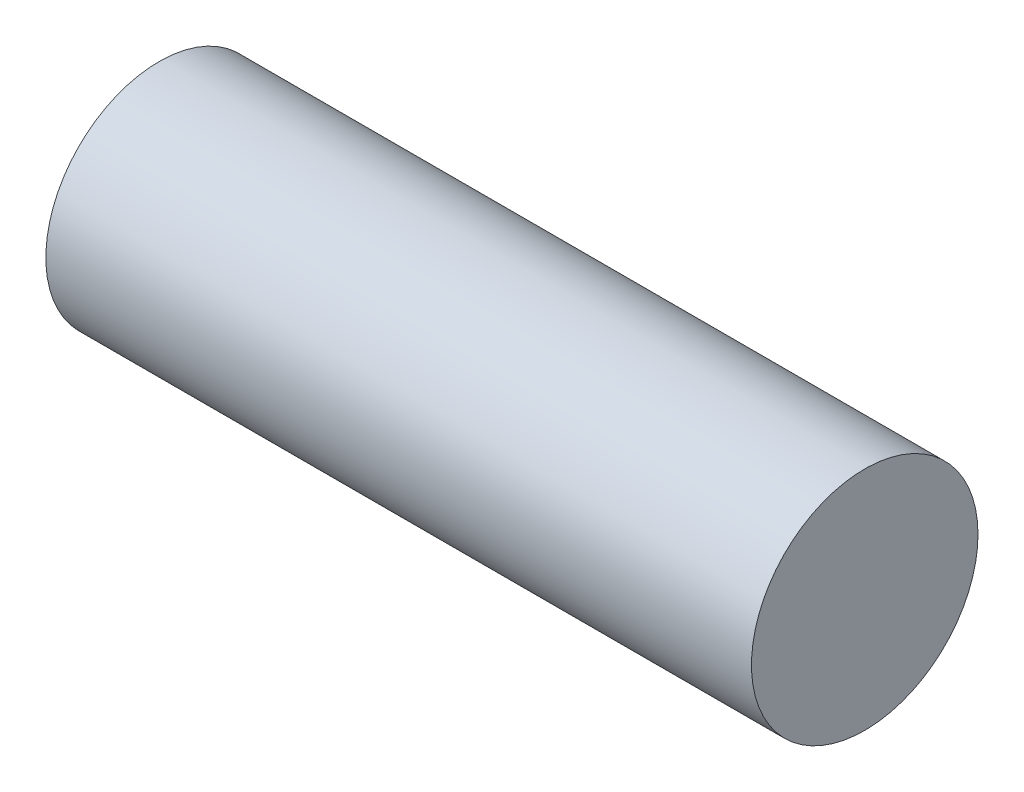
ISO-10303-21;
HEADER;
FILE_DESCRIPTION(('STEP AP214'),'2;1');
FILE_NAME('part.step','',(''),(''),'','','');
FILE_SCHEMA(('AUTOMOTIVE_DESIGN { 1 0 10303 214 1 1 1 1 }'));
ENDSEC;
DATA;
#1=APPLICATION_CONTEXT('core data for automotive mechanical design processes');
#2=APPLICATION_PROTOCOL_DEFINITION('international standard','automotive_design',2000,#1);
#3=PRODUCT_CONTEXT('',#1,'mechanical');
#4=PRODUCT('Part','Part','',(#3));
#5=PRODUCT_RELATED_PRODUCT_CATEGORY('part','',(#4));
#6=PRODUCT_DEFINITION_FORMATION('','',#4);
#7=PRODUCT_DEFINITION_CONTEXT('part definition',#1,'design');
#8=PRODUCT_DEFINITION('design','',#6,#7);
#9=PRODUCT_DEFINITION_SHAPE('','',#8);
#10=(LENGTH_UNIT() NAMED_UNIT(*) SI_UNIT(.MILLI.,.METRE.));
#11=(NAMED_UNIT(*) PLANE_ANGLE_UNIT() SI_UNIT($,.RADIAN.));
#12=(NAMED_UNIT(*) SI_UNIT($,.STERADIAN.) SOLID_ANGLE_UNIT());
#13=UNCERTAINTY_MEASURE_WITH_UNIT(LENGTH_MEASURE(1.E-05),#10,'distance_accuracy_value','');
#14=(GEOMETRIC_REPRESENTATION_CONTEXT(3) GLOBAL_UNCERTAINTY_ASSIGNED_CONTEXT((#13)) GLOBAL_UNIT_ASSIGNED_CONTEXT((#10,
#11,#12)) REPRESENTATION_CONTEXT('',''));
#15=CARTESIAN_POINT('',(0.,0.,0.));
#16=DIRECTION('',(0.,0.,1.));
#17=DIRECTION('',(1.,0.,0.));
#18=AXIS2_PLACEMENT_3D('',#15,#16,#17);
#19=CARTESIAN_POINT('',(100.3,0.,0.));
#20=DIRECTION('',(-1.,0.,0.));
#21=DIRECTION('',(0.,0.,1.));
#22=AXIS2_PLACEMENT_3D('',#19,#20,#21);
#23=CYLINDRICAL_SURFACE('',#22,16.1);
#24=CARTESIAN_POINT('',(100.3,0.,0.));
#25=DIRECTION('',(1.,0.,0.));
#26=DIRECTION('',(0.,0.,-1.));
#27=AXIS2_PLACEMENT_3D('',#24,#25,#26);
#28=CIRCLE('',#27,16.1);
#29=CARTESIAN_POINT('',(100.3,0.,-16.1));
#30=VERTEX_POINT('',#29);
#31=EDGE_CURVE('E13',#30,#30,#28,.T.);
#32=ORIENTED_EDGE('',*,*,#31,.F.);
#33=EDGE_LOOP('',(#32));
#34=FACE_BOUND('',#33,.T.);
#35=CARTESIAN_POINT('',(0.,0.,0.));
#36=DIRECTION('',(1.,0.,0.));
#37=DIRECTION('',(0.,0.,-1.));
#38=AXIS2_PLACEMENT_3D('',#35,#36,#37);
#39=CIRCLE('',#38,16.1);
#40=CARTESIAN_POINT('',(0.,0.,-16.1));
#41=VERTEX_POINT('',#40);
#42=EDGE_CURVE('E47',#41,#41,#39,.T.);
#43=ORIENTED_EDGE('',*,*,#42,.T.);
#44=EDGE_LOOP('',(#43));
#45=FACE_BOUND('',#44,.T.);
#46=ADVANCED_FACE('F44',(#34,#45),#23,.T.);
#47=CARTESIAN_POINT('',(100.3,0.,0.));
#48=DIRECTION('',(1.,0.,0.));
#49=DIRECTION('',(0.,0.,-1.));
#50=AXIS2_PLACEMENT_3D('',#47,#48,#49);
#51=PLANE('',#50);
#52=ORIENTED_EDGE('',*,*,#31,.T.);
#53=EDGE_LOOP('',(#52));
#54=FACE_BOUND('',#53,.T.);
#55=ADVANCED_FACE('F204',(#54),#51,.T.);
#56=CARTESIAN_POINT('',(0.,0.,0.));
#57=DIRECTION('',(1.,0.,0.));
#58=DIRECTION('',(0.,0.,-1.));
#59=AXIS2_PLACEMENT_3D('',#56,#57,#58);
#60=PLANE('',#59);
#61=DIRECTION('',(0.,0.,1.));
#62=VECTOR('',#61,1.);
#63=CARTESIAN_POINT('',(0.,-1.5,3.99049534076923));
#64=LINE('',#63,#62);
#65=CARTESIAN_POINT('',(0.,-1.5,3.99049534076923));
#66=VERTEX_POINT('',#65);
#67=CARTESIAN_POINT('',(0.,-1.5,11.9904953407692));
#68=VERTEX_POINT('',#67);
#69=EDGE_CURVE('E137',#66,#68,#64,.T.);
#70=ORIENTED_EDGE('',*,*,#69,.F.);
#71=CARTESIAN_POINT('',(0.,-1.75,5.74049534076923));
#72=DIRECTION('',(-1.,0.,0.));
#73=DIRECTION('',(0.,0.,-1.));
#74=AXIS2_PLACEMENT_3D('',#71,#72,#73);
#75=CIRCLE('',#74,1.76776695296637);
#76=CARTESIAN_POINT('',(0.,0.,5.99049534076923));
#77=VERTEX_POINT('',#76);
#78=EDGE_CURVE('E58',#77,#66,#75,.T.);
#79=ORIENTED_EDGE('',*,*,#78,.F.);
#80=DIRECTION('',(0.,0.,-1.));
#81=VECTOR('',#80,1.);
#82=CARTESIAN_POINT('',(0.,0.,5.99049534076923));
#83=LINE('',#82,#81);
#84=CARTESIAN_POINT('',(0.,0.,9.99049534076923));
#85=VERTEX_POINT('',#84);
#86=EDGE_CURVE('E128',#85,#77,#83,.T.);
#87=ORIENTED_EDGE('',*,*,#86,.F.);
#88=CARTESIAN_POINT('',(0.,-1.75000000000003,10.2404953407692));
#89=DIRECTION('',(-1.,0.,0.));
#90=DIRECTION('',(0.,0.,-1.));
#91=AXIS2_PLACEMENT_3D('',#88,#89,#90);
#92=CIRCLE('',#91,1.7677669529664);
#93=EDGE_CURVE('E131',#68,#85,#92,.T.);
#94=ORIENTED_EDGE('',*,*,#93,.F.);
#95=EDGE_LOOP('',(#70,#79,#87,#94));
#96=FACE_BOUND('',#95,.T.);
#97=DIRECTION('',(0.,0.,1.));
#98=VECTOR('',#97,1.);
#99=CARTESIAN_POINT('',(0.,-2.27929406394622,1.));
#100=LINE('',#99,#98);
#101=CARTESIAN_POINT('',(0.,-2.27929406394622,-9.));
#102=VERTEX_POINT('',#101);
#103=CARTESIAN_POINT('',(0.,-2.27929406394622,1.));
#104=VERTEX_POINT('',#103);
#105=EDGE_CURVE('E161',#102,#104,#100,.T.);
#106=ORIENTED_EDGE('',*,*,#105,.F.);
#107=DIRECTION('',(0.,-1.,0.));
#108=VECTOR('',#107,1.);
#109=CARTESIAN_POINT('',(0.,-2.27929406394622,-9.));
#110=LINE('',#109,#108);
#111=CARTESIAN_POINT('',(0.,2.72070593605378,-9.));
#112=VERTEX_POINT('',#111);
#113=EDGE_CURVE('E66',#112,#102,#110,.T.);
#114=ORIENTED_EDGE('',*,*,#113,.F.);
#115=DIRECTION('',(0.,0.,-1.));
#116=VECTOR('',#115,1.);
#117=CARTESIAN_POINT('',(0.,2.72070593605378,-9.));
#118=LINE('',#117,#116);
#119=CARTESIAN_POINT('',(0.,2.72070593605378,0.999999999999999));
#120=VERTEX_POINT('',#119);
#121=EDGE_CURVE('E150',#120,#112,#118,.T.);
#122=ORIENTED_EDGE('',*,*,#121,.F.);
#123=DIRECTION('',(0.,1.,0.));
#124=VECTOR('',#123,1.);
#125=CARTESIAN_POINT('',(0.,2.72070593605378,0.999999999999999));
#126=LINE('',#125,#124);
#127=EDGE_CURVE('E164',#104,#120,#126,.T.);
#128=ORIENTED_EDGE('',*,*,#127,.F.);
#129=EDGE_LOOP('',(#106,#114,#122,#128));
#130=FACE_BOUND('',#129,.T.);
#131=ORIENTED_EDGE('',*,*,#42,.F.);
#132=EDGE_LOOP('',(#131));
#133=FACE_BOUND('',#132,.T.);
#134=ADVANCED_FACE('F182',(#96,#130,#133),#60,.F.);
#135=CARTESIAN_POINT('',(10.,-2.27929406394622,-9.));
#136=DIRECTION('',(0.,0.,-1.));
#137=DIRECTION('',(-1.,0.,0.));
#138=AXIS2_PLACEMENT_3D('',#135,#136,#137);
#139=PLANE('',#138);
#140=ORIENTED_EDGE('',*,*,#113,.T.);
#141=DIRECTION('',(-1.,0.,0.));
#142=VECTOR('',#141,1.);
#143=CARTESIAN_POINT('',(10.,-2.27929406394622,-9.));
#144=LINE('',#143,#142);
#145=CARTESIAN_POINT('',(10.,-2.27929406394622,-9.));
#146=VERTEX_POINT('',#145);
#147=EDGE_CURVE('E159',#146,#102,#144,.T.);
#148=ORIENTED_EDGE('',*,*,#147,.F.);
#149=DIRECTION('',(0.,-1.,0.));
#150=VECTOR('',#149,1.);
#151=CARTESIAN_POINT('',(10.,-2.27929406394622,-9.));
#152=LINE('',#151,#150);
#153=CARTESIAN_POINT('',(10.,2.72070593605378,-9.));
#154=VERTEX_POINT('',#153);
#155=EDGE_CURVE('E146',#154,#146,#152,.T.);
#156=ORIENTED_EDGE('',*,*,#155,.F.);
#157=DIRECTION('',(-1.,0.,0.));
#158=VECTOR('',#157,1.);
#159=CARTESIAN_POINT('',(10.,2.72070593605378,-9.));
#160=LINE('',#159,#158);
#161=EDGE_CURVE('E169',#154,#112,#160,.T.);
#162=ORIENTED_EDGE('',*,*,#161,.T.);
#163=EDGE_LOOP('',(#140,#148,#156,#162));
#164=FACE_BOUND('',#163,.T.);
#165=ADVANCED_FACE('F191',(#164),#139,.F.);
#166=CARTESIAN_POINT('',(10.,2.72070593605378,-9.));
#167=DIRECTION('',(0.,1.,0.));
#168=DIRECTION('',(0.,0.,1.));
#169=AXIS2_PLACEMENT_3D('',#166,#167,#168);
#170=PLANE('',#169);
#171=ORIENTED_EDGE('',*,*,#121,.T.);
#172=ORIENTED_EDGE('',*,*,#161,.F.);
#173=DIRECTION('',(0.,0.,-1.));
#174=VECTOR('',#173,1.);
#175=CARTESIAN_POINT('',(10.,2.72070593605378,-9.));
#176=LINE('',#175,#174);
#177=CARTESIAN_POINT('',(10.,2.72070593605378,0.999999999999999));
#178=VERTEX_POINT('',#177);
#179=EDGE_CURVE('E156',#178,#154,#176,.T.);
#180=ORIENTED_EDGE('',*,*,#179,.F.);
#181=DIRECTION('',(-1.,0.,0.));
#182=VECTOR('',#181,1.);
#183=CARTESIAN_POINT('',(10.,2.72070593605378,0.999999999999999));
#184=LINE('',#183,#182);
#185=EDGE_CURVE('E171',#178,#120,#184,.T.);
#186=ORIENTED_EDGE('',*,*,#185,.T.);
#187=EDGE_LOOP('',(#171,#172,#180,#186));
#188=FACE_BOUND('',#187,.T.);
#189=ADVANCED_FACE('F193',(#188),#170,.F.);
#190=CARTESIAN_POINT('',(10.,2.72070593605378,0.999999999999999));
#191=DIRECTION('',(0.,0.,1.));
#192=DIRECTION('',(0.,-1.,0.));
#193=AXIS2_PLACEMENT_3D('',#190,#191,#192);
#194=PLANE('',#193);
#195=ORIENTED_EDGE('',*,*,#127,.T.);
#196=ORIENTED_EDGE('',*,*,#185,.F.);
#197=DIRECTION('',(0.,1.,0.));
#198=VECTOR('',#197,1.);
#199=CARTESIAN_POINT('',(10.,2.72070593605378,0.999999999999999));
#200=LINE('',#199,#198);
#201=CARTESIAN_POINT('',(10.,-2.27929406394622,1.));
#202=VERTEX_POINT('',#201);
#203=EDGE_CURVE('E153',#202,#178,#200,.T.);
#204=ORIENTED_EDGE('',*,*,#203,.F.);
#205=DIRECTION('',(-1.,0.,0.));
#206=VECTOR('',#205,1.);
#207=CARTESIAN_POINT('',(10.,-2.27929406394622,1.));
#208=LINE('',#207,#206);
#209=EDGE_CURVE('E173',#202,#104,#208,.T.);
#210=ORIENTED_EDGE('',*,*,#209,.T.);
#211=EDGE_LOOP('',(#195,#196,#204,#210));
#212=FACE_BOUND('',#211,.T.);
#213=ADVANCED_FACE('F186',(#212),#194,.F.);
#214=CARTESIAN_POINT('',(10.,-2.27929406394622,1.));
#215=DIRECTION('',(0.,-1.,0.));
#216=DIRECTION('',(0.,0.,-1.));
#217=AXIS2_PLACEMENT_3D('',#214,#215,#216);
#218=PLANE('',#217);
#219=ORIENTED_EDGE('',*,*,#105,.T.);
#220=ORIENTED_EDGE('',*,*,#209,.F.);
#221=DIRECTION('',(0.,0.,1.));
#222=VECTOR('',#221,1.);
#223=CARTESIAN_POINT('',(10.,-2.27929406394622,1.));
#224=LINE('',#223,#222);
#225=EDGE_CURVE('E149',#146,#202,#224,.T.);
#226=ORIENTED_EDGE('',*,*,#225,.F.);
#227=ORIENTED_EDGE('',*,*,#147,.T.);
#228=EDGE_LOOP('',(#219,#220,#226,#227));
#229=FACE_BOUND('',#228,.T.);
#230=ADVANCED_FACE('F178',(#229),#218,.F.);
#231=CARTESIAN_POINT('',(10.,0.,0.));
#232=DIRECTION('',(1.,0.,0.));
#233=DIRECTION('',(0.,0.,-1.));
#234=AXIS2_PLACEMENT_3D('',#231,#232,#233);
#235=PLANE('',#234);
#236=ORIENTED_EDGE('',*,*,#155,.T.);
#237=ORIENTED_EDGE('',*,*,#225,.T.);
#238=ORIENTED_EDGE('',*,*,#203,.T.);
#239=ORIENTED_EDGE('',*,*,#179,.T.);
#240=EDGE_LOOP('',(#236,#237,#238,#239));
#241=FACE_BOUND('',#240,.T.);
#242=ADVANCED_FACE('F190',(#241),#235,.F.);
#243=CARTESIAN_POINT('',(10.,-1.75,5.74049534076923));
#244=DIRECTION('',(-1.,0.,0.));
#245=DIRECTION('',(0.,0.,1.));
#246=AXIS2_PLACEMENT_3D('',#243,#244,#245);
#247=CYLINDRICAL_SURFACE('',#246,1.76776695296637);
#248=ORIENTED_EDGE('',*,*,#78,.T.);
#249=DIRECTION('',(-1.,0.,0.));
#250=VECTOR('',#249,1.);
#251=CARTESIAN_POINT('',(10.,-1.5,3.99049534076923));
#252=LINE('',#251,#250);
#253=CARTESIAN_POINT('',(10.,-1.5,3.99049534076923));
#254=VERTEX_POINT('',#253);
#255=EDGE_CURVE('E106',#254,#66,#252,.T.);
#256=ORIENTED_EDGE('',*,*,#255,.F.);
#257=CARTESIAN_POINT('',(10.,-1.75,5.74049534076923));
#258=DIRECTION('',(-1.,0.,0.));
#259=DIRECTION('',(0.,0.,-1.));
#260=AXIS2_PLACEMENT_3D('',#257,#258,#259);
#261=CIRCLE('',#260,1.76776695296637);
#262=CARTESIAN_POINT('',(10.,0.,5.99049534076923));
#263=VERTEX_POINT('',#262);
#264=EDGE_CURVE('E110',#263,#254,#261,.T.);
#265=ORIENTED_EDGE('',*,*,#264,.F.);
#266=DIRECTION('',(-1.,0.,0.));
#267=VECTOR('',#266,1.);
#268=CARTESIAN_POINT('',(10.,0.,5.99049534076923));
#269=LINE('',#268,#267);
#270=EDGE_CURVE('E141',#263,#77,#269,.T.);
#271=ORIENTED_EDGE('',*,*,#270,.T.);
#272=EDGE_LOOP('',(#248,#256,#265,#271));
#273=FACE_BOUND('',#272,.T.);
#274=ADVANCED_FACE('F108',(#273),#247,.F.);
#275=CARTESIAN_POINT('',(10.,0.,5.99049534076923));
#276=DIRECTION('',(0.,1.,0.));
#277=DIRECTION('',(0.,0.,1.));
#278=AXIS2_PLACEMENT_3D('',#275,#276,#277);
#279=PLANE('',#278);
#280=ORIENTED_EDGE('',*,*,#86,.T.);
#281=ORIENTED_EDGE('',*,*,#270,.F.);
#282=DIRECTION('',(0.,0.,-1.));
#283=VECTOR('',#282,1.);
#284=CARTESIAN_POINT('',(10.,0.,5.99049534076923));
#285=LINE('',#284,#283);
#286=CARTESIAN_POINT('',(10.,0.,9.99049534076923));
#287=VERTEX_POINT('',#286);
#288=EDGE_CURVE('E116',#287,#263,#285,.T.);
#289=ORIENTED_EDGE('',*,*,#288,.F.);
#290=DIRECTION('',(-1.,0.,0.));
#291=VECTOR('',#290,1.);
#292=CARTESIAN_POINT('',(10.,0.,9.99049534076923));
#293=LINE('',#292,#291);
#294=EDGE_CURVE('E143',#287,#85,#293,.T.);
#295=ORIENTED_EDGE('',*,*,#294,.T.);
#296=EDGE_LOOP('',(#280,#281,#289,#295));
#297=FACE_BOUND('',#296,.T.);
#298=ADVANCED_FACE('F227',(#297),#279,.F.);
#299=CARTESIAN_POINT('',(10.,-1.75000000000003,10.2404953407692));
#300=DIRECTION('',(-1.,0.,0.));
#301=DIRECTION('',(0.,0.,1.));
#302=AXIS2_PLACEMENT_3D('',#299,#300,#301);
#303=CYLINDRICAL_SURFACE('',#302,1.7677669529664);
#304=ORIENTED_EDGE('',*,*,#93,.T.);
#305=ORIENTED_EDGE('',*,*,#294,.F.);
#306=CARTESIAN_POINT('',(10.,-1.75000000000003,10.2404953407692));
#307=DIRECTION('',(-1.,0.,0.));
#308=DIRECTION('',(0.,0.,-1.));
#309=AXIS2_PLACEMENT_3D('',#306,#307,#308);
#310=CIRCLE('',#309,1.7677669529664);
#311=CARTESIAN_POINT('',(10.,-1.5,11.9904953407692));
#312=VERTEX_POINT('',#311);
#313=EDGE_CURVE('E124',#312,#287,#310,.T.);
#314=ORIENTED_EDGE('',*,*,#313,.F.);
#315=DIRECTION('',(-1.,0.,0.));
#316=VECTOR('',#315,1.);
#317=CARTESIAN_POINT('',(10.,-1.5,11.9904953407692));
#318=LINE('',#317,#316);
#319=EDGE_CURVE('E115',#312,#68,#318,.T.);
#320=ORIENTED_EDGE('',*,*,#319,.T.);
#321=EDGE_LOOP('',(#304,#305,#314,#320));
#322=FACE_BOUND('',#321,.T.);
#323=ADVANCED_FACE('F232',(#322),#303,.F.);
#324=CARTESIAN_POINT('',(10.,-1.5,3.99049534076923));
#325=DIRECTION('',(0.,-1.,0.));
#326=DIRECTION('',(0.,0.,-1.));
#327=AXIS2_PLACEMENT_3D('',#324,#325,#326);
#328=PLANE('',#327);
#329=ORIENTED_EDGE('',*,*,#69,.T.);
#330=ORIENTED_EDGE('',*,*,#319,.F.);
#331=DIRECTION('',(0.,0.,1.));
#332=VECTOR('',#331,1.);
#333=CARTESIAN_POINT('',(10.,-1.5,3.99049534076923));
#334=LINE('',#333,#332);
#335=EDGE_CURVE('E119',#254,#312,#334,.T.);
#336=ORIENTED_EDGE('',*,*,#335,.F.);
#337=ORIENTED_EDGE('',*,*,#255,.T.);
#338=EDGE_LOOP('',(#329,#330,#336,#337));
#339=FACE_BOUND('',#338,.T.);
#340=ADVANCED_FACE('F120',(#339),#328,.F.);
#341=CARTESIAN_POINT('',(10.,-1.75,5.74049534076923));
#342=DIRECTION('',(1.,0.,0.));
#343=DIRECTION('',(0.,0.,-1.));
#344=AXIS2_PLACEMENT_3D('',#341,#342,#343);
#345=PLANE('',#344);
#346=ORIENTED_EDGE('',*,*,#264,.T.);
#347=ORIENTED_EDGE('',*,*,#335,.T.);
#348=ORIENTED_EDGE('',*,*,#313,.T.);
#349=ORIENTED_EDGE('',*,*,#288,.T.);
#350=EDGE_LOOP('',(#346,#347,#348,#349));
#351=FACE_BOUND('',#350,.T.);
#352=ADVANCED_FACE('F126',(#351),#345,.F.);
#353=CLOSED_SHELL('',(#46,#55,#134,#165,#189,#213,#230,#242,#274,#298,#323,#340,#352));
#354=MANIFOLD_SOLID_BREP('B2',#353);
#355=ADVANCED_BREP_SHAPE_REPRESENTATION('',(#18,#354),#14);
#356=SHAPE_DEFINITION_REPRESENTATION(#9,#355);
ENDSEC;
END-ISO-10303-21;
